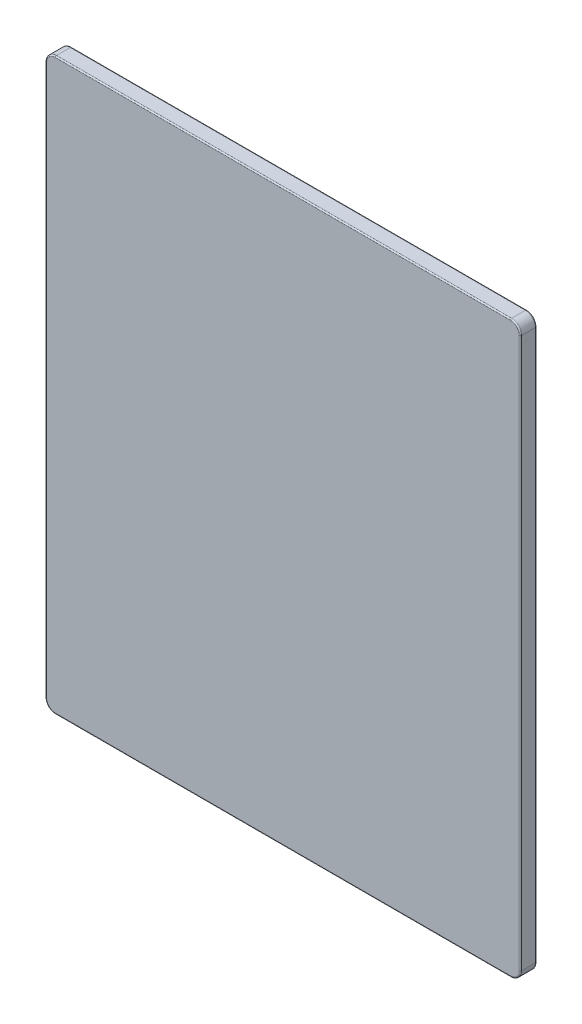
ISO-10303-21;
HEADER;
FILE_DESCRIPTION(('STEP AP214'),'2;1');
FILE_NAME('part.step','',(''),(''),'','','');
FILE_SCHEMA(('AUTOMOTIVE_DESIGN { 1 0 10303 214 1 1 1 1 }'));
ENDSEC;
DATA;
#1=APPLICATION_CONTEXT('core data for automotive mechanical design processes');
#2=APPLICATION_PROTOCOL_DEFINITION('international standard','automotive_design',2000,#1);
#3=PRODUCT_CONTEXT('',#1,'mechanical');
#4=PRODUCT('Part','Part','',(#3));
#5=PRODUCT_RELATED_PRODUCT_CATEGORY('part','',(#4));
#6=PRODUCT_DEFINITION_FORMATION('','',#4);
#7=PRODUCT_DEFINITION_CONTEXT('part definition',#1,'design');
#8=PRODUCT_DEFINITION('design','',#6,#7);
#9=PRODUCT_DEFINITION_SHAPE('','',#8);
#10=(LENGTH_UNIT() NAMED_UNIT(*) SI_UNIT(.MILLI.,.METRE.));
#11=(NAMED_UNIT(*) PLANE_ANGLE_UNIT() SI_UNIT($,.RADIAN.));
#12=(NAMED_UNIT(*) SI_UNIT($,.STERADIAN.) SOLID_ANGLE_UNIT());
#13=UNCERTAINTY_MEASURE_WITH_UNIT(LENGTH_MEASURE(1.E-05),#10,'distance_accuracy_value','');
#14=(GEOMETRIC_REPRESENTATION_CONTEXT(3) GLOBAL_UNCERTAINTY_ASSIGNED_CONTEXT((#13)) GLOBAL_UNIT_ASSIGNED_CONTEXT((#10,
#11,#12)) REPRESENTATION_CONTEXT('',''));
#15=CARTESIAN_POINT('',(0.,0.,0.));
#16=DIRECTION('',(0.,0.,1.));
#17=DIRECTION('',(1.,0.,0.));
#18=AXIS2_PLACEMENT_3D('',#15,#16,#17);
#19=CARTESIAN_POINT('',(190.5,-228.6,13.));
#20=DIRECTION('',(-1.,0.,0.));
#21=DIRECTION('',(0.,0.,1.));
#22=AXIS2_PLACEMENT_3D('',#19,#20,#21);
#23=PLANE('',#22);
#24=DIRECTION('',(0.,0.,-1.));
#25=VECTOR('',#24,1.);
#26=CARTESIAN_POINT('',(190.5,-220.6,13.));
#27=LINE('',#26,#25);
#28=CARTESIAN_POINT('',(190.5,-220.6,12.));
#29=VERTEX_POINT('',#28);
#30=CARTESIAN_POINT('',(190.5,-220.6,0.999999999999999));
#31=VERTEX_POINT('',#30);
#32=EDGE_CURVE('E334',#29,#31,#27,.T.);
#33=ORIENTED_EDGE('',*,*,#32,.T.);
#34=DIRECTION('',(0.,1.,0.));
#35=VECTOR('',#34,1.);
#36=CARTESIAN_POINT('',(190.5,220.6,0.999999999999999));
#37=LINE('',#36,#35);
#38=CARTESIAN_POINT('',(190.5,220.6,0.999999999999999));
#39=VERTEX_POINT('',#38);
#40=EDGE_CURVE('E221',#31,#39,#37,.T.);
#41=ORIENTED_EDGE('',*,*,#40,.T.);
#42=DIRECTION('',(0.,0.,-1.));
#43=VECTOR('',#42,1.);
#44=CARTESIAN_POINT('',(190.5,220.6,13.));
#45=LINE('',#44,#43);
#46=CARTESIAN_POINT('',(190.5,220.6,12.));
#47=VERTEX_POINT('',#46);
#48=EDGE_CURVE('E340',#39,#47,#45,.F.);
#49=ORIENTED_EDGE('',*,*,#48,.T.);
#50=DIRECTION('',(0.,1.,0.));
#51=VECTOR('',#50,1.);
#52=CARTESIAN_POINT('',(190.5,-228.6,12.));
#53=LINE('',#52,#51);
#54=EDGE_CURVE('E218',#47,#29,#53,.F.);
#55=ORIENTED_EDGE('',*,*,#54,.T.);
#56=EDGE_LOOP('',(#33,#41,#49,#55));
#57=FACE_BOUND('',#56,.T.);
#58=ADVANCED_FACE('F39',(#57),#23,.F.);
#59=CARTESIAN_POINT('',(-190.5,228.6,13.));
#60=DIRECTION('',(0.,-1.,0.));
#61=DIRECTION('',(0.,0.,-1.));
#62=AXIS2_PLACEMENT_3D('',#59,#60,#61);
#63=PLANE('',#62);
#64=DIRECTION('',(0.,0.,-1.));
#65=VECTOR('',#64,1.);
#66=CARTESIAN_POINT('',(182.5,228.6,13.));
#67=LINE('',#66,#65);
#68=CARTESIAN_POINT('',(182.5,228.6,12.));
#69=VERTEX_POINT('',#68);
#70=CARTESIAN_POINT('',(182.5,228.6,0.999999999999999));
#71=VERTEX_POINT('',#70);
#72=EDGE_CURVE('E331',#69,#71,#67,.T.);
#73=ORIENTED_EDGE('',*,*,#72,.T.);
#74=DIRECTION('',(-1.,0.,0.));
#75=VECTOR('',#74,1.);
#76=CARTESIAN_POINT('',(-182.5,228.6,0.999999999999999));
#77=LINE('',#76,#75);
#78=CARTESIAN_POINT('',(-182.5,228.6,0.999999999999999));
#79=VERTEX_POINT('',#78);
#80=EDGE_CURVE('E233',#71,#79,#77,.T.);
#81=ORIENTED_EDGE('',*,*,#80,.T.);
#82=DIRECTION('',(0.,0.,-1.));
#83=VECTOR('',#82,1.);
#84=CARTESIAN_POINT('',(-182.5,228.6,13.));
#85=LINE('',#84,#83);
#86=CARTESIAN_POINT('',(-182.5,228.6,12.));
#87=VERTEX_POINT('',#86);
#88=EDGE_CURVE('E279',#79,#87,#85,.F.);
#89=ORIENTED_EDGE('',*,*,#88,.T.);
#90=DIRECTION('',(-1.,0.,0.));
#91=VECTOR('',#90,1.);
#92=CARTESIAN_POINT('',(-190.5,228.6,12.));
#93=LINE('',#92,#91);
#94=EDGE_CURVE('E230',#87,#69,#93,.F.);
#95=ORIENTED_EDGE('',*,*,#94,.T.);
#96=EDGE_LOOP('',(#73,#81,#89,#95));
#97=FACE_BOUND('',#96,.T.);
#98=ADVANCED_FACE('F328',(#97),#63,.F.);
#99=CARTESIAN_POINT('',(-190.5,-228.6,13.));
#100=DIRECTION('',(1.,0.,0.));
#101=DIRECTION('',(0.,0.,-1.));
#102=AXIS2_PLACEMENT_3D('',#99,#100,#101);
#103=PLANE('',#102);
#104=DIRECTION('',(0.,0.,-1.));
#105=VECTOR('',#104,1.);
#106=CARTESIAN_POINT('',(-190.5,220.6,13.));
#107=LINE('',#106,#105);
#108=CARTESIAN_POINT('',(-190.5,220.6,12.));
#109=VERTEX_POINT('',#108);
#110=CARTESIAN_POINT('',(-190.5,220.6,0.999999999999999));
#111=VERTEX_POINT('',#110);
#112=EDGE_CURVE('E325',#109,#111,#107,.T.);
#113=ORIENTED_EDGE('',*,*,#112,.T.);
#114=DIRECTION('',(0.,-1.,0.));
#115=VECTOR('',#114,1.);
#116=CARTESIAN_POINT('',(-190.5,-220.6,0.999999999999999));
#117=LINE('',#116,#115);
#118=CARTESIAN_POINT('',(-190.5,-220.6,0.999999999999999));
#119=VERTEX_POINT('',#118);
#120=EDGE_CURVE('E196',#111,#119,#117,.T.);
#121=ORIENTED_EDGE('',*,*,#120,.T.);
#122=DIRECTION('',(0.,0.,-1.));
#123=VECTOR('',#122,1.);
#124=CARTESIAN_POINT('',(-190.5,-220.6,13.));
#125=LINE('',#124,#123);
#126=CARTESIAN_POINT('',(-190.5,-220.6,12.));
#127=VERTEX_POINT('',#126);
#128=EDGE_CURVE('E344',#119,#127,#125,.F.);
#129=ORIENTED_EDGE('',*,*,#128,.T.);
#130=DIRECTION('',(0.,-1.,0.));
#131=VECTOR('',#130,1.);
#132=CARTESIAN_POINT('',(-190.5,-228.6,12.));
#133=LINE('',#132,#131);
#134=EDGE_CURVE('E193',#127,#109,#133,.F.);
#135=ORIENTED_EDGE('',*,*,#134,.T.);
#136=EDGE_LOOP('',(#113,#121,#129,#135));
#137=FACE_BOUND('',#136,.T.);
#138=ADVANCED_FACE('F380',(#137),#103,.F.);
#139=CARTESIAN_POINT('',(-190.5,-228.6,13.));
#140=DIRECTION('',(0.,1.,0.));
#141=DIRECTION('',(0.,0.,1.));
#142=AXIS2_PLACEMENT_3D('',#139,#140,#141);
#143=PLANE('',#142);
#144=DIRECTION('',(0.,0.,-1.));
#145=VECTOR('',#144,1.);
#146=CARTESIAN_POINT('',(-182.5,-228.6,13.));
#147=LINE('',#146,#145);
#148=CARTESIAN_POINT('',(-182.5,-228.6,12.));
#149=VERTEX_POINT('',#148);
#150=CARTESIAN_POINT('',(-182.5,-228.6,0.999999999999999));
#151=VERTEX_POINT('',#150);
#152=EDGE_CURVE('E350',#149,#151,#147,.T.);
#153=ORIENTED_EDGE('',*,*,#152,.T.);
#154=DIRECTION('',(1.,0.,0.));
#155=VECTOR('',#154,1.);
#156=CARTESIAN_POINT('',(182.5,-228.6,0.999999999999999));
#157=LINE('',#156,#155);
#158=CARTESIAN_POINT('',(182.5,-228.6,0.999999999999999));
#159=VERTEX_POINT('',#158);
#160=EDGE_CURVE('E208',#151,#159,#157,.T.);
#161=ORIENTED_EDGE('',*,*,#160,.T.);
#162=DIRECTION('',(0.,0.,-1.));
#163=VECTOR('',#162,1.);
#164=CARTESIAN_POINT('',(182.5,-228.6,13.));
#165=LINE('',#164,#163);
#166=CARTESIAN_POINT('',(182.5,-228.6,12.));
#167=VERTEX_POINT('',#166);
#168=EDGE_CURVE('E175',#159,#167,#165,.F.);
#169=ORIENTED_EDGE('',*,*,#168,.T.);
#170=DIRECTION('',(1.,0.,0.));
#171=VECTOR('',#170,1.);
#172=CARTESIAN_POINT('',(-190.5,-228.6,12.));
#173=LINE('',#172,#171);
#174=EDGE_CURVE('E205',#167,#149,#173,.F.);
#175=ORIENTED_EDGE('',*,*,#174,.T.);
#176=EDGE_LOOP('',(#153,#161,#169,#175));
#177=FACE_BOUND('',#176,.T.);
#178=ADVANCED_FACE('F423',(#177),#143,.F.);
#179=CARTESIAN_POINT('',(0.,0.,13.));
#180=DIRECTION('',(0.,0.,-1.));
#181=DIRECTION('',(-1.,0.,0.));
#182=AXIS2_PLACEMENT_3D('',#179,#180,#181);
#183=PLANE('',#182);
#184=DIRECTION('',(1.,0.,0.));
#185=VECTOR('',#184,1.);
#186=CARTESIAN_POINT('',(0.,-227.6,13.));
#187=LINE('',#186,#185);
#188=CARTESIAN_POINT('',(-182.5,-227.6,13.));
#189=VERTEX_POINT('',#188);
#190=CARTESIAN_POINT('',(182.5,-227.6,13.));
#191=VERTEX_POINT('',#190);
#192=EDGE_CURVE('E49',#189,#191,#187,.T.);
#193=ORIENTED_EDGE('',*,*,#192,.T.);
#194=CARTESIAN_POINT('',(182.5,-220.6,13.));
#195=DIRECTION('',(0.,0.,-1.));
#196=DIRECTION('',(-1.,0.,0.));
#197=AXIS2_PLACEMENT_3D('',#194,#195,#196);
#198=CIRCLE('',#197,7.);
#199=CARTESIAN_POINT('',(189.5,-220.6,13.));
#200=VERTEX_POINT('',#199);
#201=EDGE_CURVE('E11',#191,#200,#198,.F.);
#202=ORIENTED_EDGE('',*,*,#201,.T.);
#203=DIRECTION('',(0.,1.,0.));
#204=VECTOR('',#203,1.);
#205=CARTESIAN_POINT('',(189.5,0.,13.));
#206=LINE('',#205,#204);
#207=CARTESIAN_POINT('',(189.5,220.6,13.));
#208=VERTEX_POINT('',#207);
#209=EDGE_CURVE('E236',#200,#208,#206,.T.);
#210=ORIENTED_EDGE('',*,*,#209,.T.);
#211=CARTESIAN_POINT('',(182.5,220.6,13.));
#212=DIRECTION('',(0.,0.,-1.));
#213=DIRECTION('',(-1.,0.,0.));
#214=AXIS2_PLACEMENT_3D('',#211,#212,#213);
#215=CIRCLE('',#214,7.);
#216=CARTESIAN_POINT('',(182.5,227.6,13.));
#217=VERTEX_POINT('',#216);
#218=EDGE_CURVE('E239',#208,#217,#215,.F.);
#219=ORIENTED_EDGE('',*,*,#218,.T.);
#220=DIRECTION('',(-1.,0.,0.));
#221=VECTOR('',#220,1.);
#222=CARTESIAN_POINT('',(0.,227.6,13.));
#223=LINE('',#222,#221);
#224=CARTESIAN_POINT('',(-182.5,227.6,13.));
#225=VERTEX_POINT('',#224);
#226=EDGE_CURVE('E242',#217,#225,#223,.T.);
#227=ORIENTED_EDGE('',*,*,#226,.T.);
#228=CARTESIAN_POINT('',(-182.5,220.6,13.));
#229=DIRECTION('',(0.,0.,-1.));
#230=DIRECTION('',(-1.,0.,0.));
#231=AXIS2_PLACEMENT_3D('',#228,#229,#230);
#232=CIRCLE('',#231,7.);
#233=CARTESIAN_POINT('',(-189.5,220.6,13.));
#234=VERTEX_POINT('',#233);
#235=EDGE_CURVE('E245',#225,#234,#232,.F.);
#236=ORIENTED_EDGE('',*,*,#235,.T.);
#237=DIRECTION('',(0.,-1.,0.));
#238=VECTOR('',#237,1.);
#239=CARTESIAN_POINT('',(-189.5,0.,13.));
#240=LINE('',#239,#238);
#241=CARTESIAN_POINT('',(-189.5,-220.6,13.));
#242=VERTEX_POINT('',#241);
#243=EDGE_CURVE('E248',#234,#242,#240,.T.);
#244=ORIENTED_EDGE('',*,*,#243,.T.);
#245=CARTESIAN_POINT('',(-182.5,-220.6,13.));
#246=DIRECTION('',(0.,0.,-1.));
#247=DIRECTION('',(-1.,0.,0.));
#248=AXIS2_PLACEMENT_3D('',#245,#246,#247);
#249=CIRCLE('',#248,7.);
#250=EDGE_CURVE('E60',#242,#189,#249,.F.);
#251=ORIENTED_EDGE('',*,*,#250,.T.);
#252=EDGE_LOOP('',(#193,#202,#210,#219,#227,#236,#244,#251));
#253=FACE_BOUND('',#252,.T.);
#254=ADVANCED_FACE('F396',(#253),#183,.F.);
#255=CARTESIAN_POINT('',(0.,0.,0.));
#256=DIRECTION('',(0.,0.,-1.));
#257=DIRECTION('',(-1.,0.,0.));
#258=AXIS2_PLACEMENT_3D('',#255,#256,#257);
#259=PLANE('',#258);
#260=DIRECTION('',(0.,-1.,0.));
#261=VECTOR('',#260,1.);
#262=CARTESIAN_POINT('',(-189.5,220.6,0.));
#263=LINE('',#262,#261);
#264=CARTESIAN_POINT('',(-189.5,-220.6,0.));
#265=VERTEX_POINT('',#264);
#266=CARTESIAN_POINT('',(-189.5,220.6,0.));
#267=VERTEX_POINT('',#266);
#268=EDGE_CURVE('E179',#265,#267,#263,.F.);
#269=ORIENTED_EDGE('',*,*,#268,.T.);
#270=CARTESIAN_POINT('',(-182.5,220.6,0.));
#271=DIRECTION('',(0.,0.,-1.));
#272=DIRECTION('',(-1.,0.,0.));
#273=AXIS2_PLACEMENT_3D('',#270,#271,#272);
#274=CIRCLE('',#273,7.);
#275=CARTESIAN_POINT('',(-182.5,227.6,0.));
#276=VERTEX_POINT('',#275);
#277=EDGE_CURVE('E158',#267,#276,#274,.T.);
#278=ORIENTED_EDGE('',*,*,#277,.T.);
#279=DIRECTION('',(-1.,0.,0.));
#280=VECTOR('',#279,1.);
#281=CARTESIAN_POINT('',(182.5,227.6,0.));
#282=LINE('',#281,#280);
#283=CARTESIAN_POINT('',(182.5,227.6,0.));
#284=VERTEX_POINT('',#283);
#285=EDGE_CURVE('E167',#276,#284,#282,.F.);
#286=ORIENTED_EDGE('',*,*,#285,.T.);
#287=CARTESIAN_POINT('',(182.5,220.6,0.));
#288=DIRECTION('',(0.,0.,-1.));
#289=DIRECTION('',(-1.,0.,0.));
#290=AXIS2_PLACEMENT_3D('',#287,#288,#289);
#291=CIRCLE('',#290,7.);
#292=CARTESIAN_POINT('',(189.5,220.6,0.));
#293=VERTEX_POINT('',#292);
#294=EDGE_CURVE('E174',#284,#293,#291,.T.);
#295=ORIENTED_EDGE('',*,*,#294,.T.);
#296=DIRECTION('',(0.,1.,0.));
#297=VECTOR('',#296,1.);
#298=CARTESIAN_POINT('',(189.5,-220.6,0.));
#299=LINE('',#298,#297);
#300=CARTESIAN_POINT('',(189.5,-220.6,0.));
#301=VERTEX_POINT('',#300);
#302=EDGE_CURVE('E359',#293,#301,#299,.F.);
#303=ORIENTED_EDGE('',*,*,#302,.T.);
#304=CARTESIAN_POINT('',(182.5,-220.6,0.));
#305=DIRECTION('',(0.,0.,-1.));
#306=DIRECTION('',(-1.,0.,0.));
#307=AXIS2_PLACEMENT_3D('',#304,#305,#306);
#308=CIRCLE('',#307,7.);
#309=CARTESIAN_POINT('',(182.5,-227.6,0.));
#310=VERTEX_POINT('',#309);
#311=EDGE_CURVE('E362',#301,#310,#308,.T.);
#312=ORIENTED_EDGE('',*,*,#311,.T.);
#313=DIRECTION('',(1.,0.,0.));
#314=VECTOR('',#313,1.);
#315=CARTESIAN_POINT('',(-182.5,-227.6,0.));
#316=LINE('',#315,#314);
#317=CARTESIAN_POINT('',(-182.5,-227.6,0.));
#318=VERTEX_POINT('',#317);
#319=EDGE_CURVE('E365',#310,#318,#316,.F.);
#320=ORIENTED_EDGE('',*,*,#319,.T.);
#321=CARTESIAN_POINT('',(-182.5,-220.6,0.));
#322=DIRECTION('',(0.,0.,-1.));
#323=DIRECTION('',(-1.,0.,0.));
#324=AXIS2_PLACEMENT_3D('',#321,#322,#323);
#325=CIRCLE('',#324,7.);
#326=EDGE_CURVE('E187',#318,#265,#325,.T.);
#327=ORIENTED_EDGE('',*,*,#326,.T.);
#328=EDGE_LOOP('',(#269,#278,#286,#295,#303,#312,#320,#327));
#329=FACE_BOUND('',#328,.T.);
#330=ADVANCED_FACE('F177',(#329),#259,.T.);
#331=CARTESIAN_POINT('',(182.5,220.6,13.));
#332=DIRECTION('',(0.,0.,-1.));
#333=DIRECTION('',(-1.,0.,0.));
#334=AXIS2_PLACEMENT_3D('',#331,#332,#333);
#335=CYLINDRICAL_SURFACE('',#334,8.);
#336=ORIENTED_EDGE('',*,*,#48,.F.);
#337=CARTESIAN_POINT('',(182.5,220.6,0.999999999999999));
#338=DIRECTION('',(0.,0.,-1.));
#339=DIRECTION('',(-1.,0.,0.));
#340=AXIS2_PLACEMENT_3D('',#337,#338,#339);
#341=CIRCLE('',#340,8.);
#342=EDGE_CURVE('E227',#39,#71,#341,.F.);
#343=ORIENTED_EDGE('',*,*,#342,.T.);
#344=ORIENTED_EDGE('',*,*,#72,.F.);
#345=CARTESIAN_POINT('',(182.5,220.6,12.));
#346=DIRECTION('',(0.,0.,-1.));
#347=DIRECTION('',(-1.,0.,0.));
#348=AXIS2_PLACEMENT_3D('',#345,#346,#347);
#349=CIRCLE('',#348,8.);
#350=EDGE_CURVE('E224',#69,#47,#349,.T.);
#351=ORIENTED_EDGE('',*,*,#350,.T.);
#352=EDGE_LOOP('',(#336,#343,#344,#351));
#353=FACE_BOUND('',#352,.T.);
#354=ADVANCED_FACE('F440',(#353),#335,.T.);
#355=CARTESIAN_POINT('',(-182.5,220.6,13.));
#356=DIRECTION('',(0.,0.,-1.));
#357=DIRECTION('',(-1.,0.,0.));
#358=AXIS2_PLACEMENT_3D('',#355,#356,#357);
#359=CYLINDRICAL_SURFACE('',#358,8.);
#360=ORIENTED_EDGE('',*,*,#88,.F.);
#361=CARTESIAN_POINT('',(-182.5,220.6,0.999999999999999));
#362=DIRECTION('',(0.,0.,-1.));
#363=DIRECTION('',(-1.,0.,0.));
#364=AXIS2_PLACEMENT_3D('',#361,#362,#363);
#365=CIRCLE('',#364,8.);
#366=EDGE_CURVE('E160',#79,#111,#365,.F.);
#367=ORIENTED_EDGE('',*,*,#366,.T.);
#368=ORIENTED_EDGE('',*,*,#112,.F.);
#369=CARTESIAN_POINT('',(-182.5,220.6,12.));
#370=DIRECTION('',(0.,0.,-1.));
#371=DIRECTION('',(-1.,0.,0.));
#372=AXIS2_PLACEMENT_3D('',#369,#370,#371);
#373=CIRCLE('',#372,8.);
#374=EDGE_CURVE('E182',#109,#87,#373,.T.);
#375=ORIENTED_EDGE('',*,*,#374,.T.);
#376=EDGE_LOOP('',(#360,#367,#368,#375));
#377=FACE_BOUND('',#376,.T.);
#378=ADVANCED_FACE('F323',(#377),#359,.T.);
#379=CARTESIAN_POINT('',(182.5,-220.6,13.));
#380=DIRECTION('',(0.,0.,-1.));
#381=DIRECTION('',(-1.,0.,0.));
#382=AXIS2_PLACEMENT_3D('',#379,#380,#381);
#383=CYLINDRICAL_SURFACE('',#382,8.);
#384=ORIENTED_EDGE('',*,*,#168,.F.);
#385=CARTESIAN_POINT('',(182.5,-220.6,0.999999999999999));
#386=DIRECTION('',(0.,0.,-1.));
#387=DIRECTION('',(-1.,0.,0.));
#388=AXIS2_PLACEMENT_3D('',#385,#386,#387);
#389=CIRCLE('',#388,8.);
#390=EDGE_CURVE('E215',#159,#31,#389,.F.);
#391=ORIENTED_EDGE('',*,*,#390,.T.);
#392=ORIENTED_EDGE('',*,*,#32,.F.);
#393=CARTESIAN_POINT('',(182.5,-220.6,12.));
#394=DIRECTION('',(0.,0.,-1.));
#395=DIRECTION('',(-1.,0.,0.));
#396=AXIS2_PLACEMENT_3D('',#393,#394,#395);
#397=CIRCLE('',#396,8.);
#398=EDGE_CURVE('E211',#29,#167,#397,.T.);
#399=ORIENTED_EDGE('',*,*,#398,.T.);
#400=EDGE_LOOP('',(#384,#391,#392,#399));
#401=FACE_BOUND('',#400,.T.);
#402=ADVANCED_FACE('F412',(#401),#383,.T.);
#403=CARTESIAN_POINT('',(-182.5,-220.6,13.));
#404=DIRECTION('',(0.,0.,-1.));
#405=DIRECTION('',(-1.,0.,0.));
#406=AXIS2_PLACEMENT_3D('',#403,#404,#405);
#407=CYLINDRICAL_SURFACE('',#406,8.);
#408=ORIENTED_EDGE('',*,*,#128,.F.);
#409=CARTESIAN_POINT('',(-182.5,-220.6,0.999999999999999));
#410=DIRECTION('',(0.,0.,-1.));
#411=DIRECTION('',(-1.,0.,0.));
#412=AXIS2_PLACEMENT_3D('',#409,#410,#411);
#413=CIRCLE('',#412,8.);
#414=EDGE_CURVE('E202',#119,#151,#413,.F.);
#415=ORIENTED_EDGE('',*,*,#414,.T.);
#416=ORIENTED_EDGE('',*,*,#152,.F.);
#417=CARTESIAN_POINT('',(-182.5,-220.6,12.));
#418=DIRECTION('',(0.,0.,-1.));
#419=DIRECTION('',(-1.,0.,0.));
#420=AXIS2_PLACEMENT_3D('',#417,#418,#419);
#421=CIRCLE('',#420,8.);
#422=EDGE_CURVE('E199',#149,#127,#421,.T.);
#423=ORIENTED_EDGE('',*,*,#422,.T.);
#424=EDGE_LOOP('',(#408,#415,#416,#423));
#425=FACE_BOUND('',#424,.T.);
#426=ADVANCED_FACE('F382',(#425),#407,.T.);
#427=CARTESIAN_POINT('',(182.5,-220.6,0.999999999999999));
#428=DIRECTION('',(0.,0.,-1.));
#429=DIRECTION('',(-1.,0.,0.));
#430=AXIS2_PLACEMENT_3D('',#427,#428,#429);
#431=TOROIDAL_SURFACE('',#430,7.,1.);
#432=CARTESIAN_POINT('',(189.5,-220.6,0.999999999999999));
#433=DIRECTION('',(0.,1.,0.));
#434=DIRECTION('',(0.,0.,1.));
#435=AXIS2_PLACEMENT_3D('',#432,#433,#434);
#436=CIRCLE('',#435,1.);
#437=EDGE_CURVE('E271',#31,#301,#436,.T.);
#438=ORIENTED_EDGE('',*,*,#437,.F.);
#439=ORIENTED_EDGE('',*,*,#390,.F.);
#440=CARTESIAN_POINT('',(182.5,-227.6,1.));
#441=DIRECTION('',(-1.,0.,0.));
#442=DIRECTION('',(0.,0.,1.));
#443=AXIS2_PLACEMENT_3D('',#440,#441,#442);
#444=CIRCLE('',#443,1.);
#445=EDGE_CURVE('E275',#310,#159,#444,.T.);
#446=ORIENTED_EDGE('',*,*,#445,.F.);
#447=ORIENTED_EDGE('',*,*,#311,.F.);
#448=EDGE_LOOP('',(#438,#439,#446,#447));
#449=FACE_BOUND('',#448,.T.);
#450=ADVANCED_FACE('F416',(#449),#431,.T.);
#451=CARTESIAN_POINT('',(-190.5,-227.6,0.999999999999999));
#452=DIRECTION('',(-1.,0.,0.));
#453=DIRECTION('',(0.,0.,1.));
#454=AXIS2_PLACEMENT_3D('',#451,#452,#453);
#455=CYLINDRICAL_SURFACE('',#454,1.);
#456=ORIENTED_EDGE('',*,*,#445,.T.);
#457=ORIENTED_EDGE('',*,*,#160,.F.);
#458=CARTESIAN_POINT('',(-182.5,-227.6,1.));
#459=DIRECTION('',(-1.,0.,0.));
#460=DIRECTION('',(0.,0.,1.));
#461=AXIS2_PLACEMENT_3D('',#458,#459,#460);
#462=CIRCLE('',#461,1.);
#463=EDGE_CURVE('E267',#318,#151,#462,.T.);
#464=ORIENTED_EDGE('',*,*,#463,.F.);
#465=ORIENTED_EDGE('',*,*,#319,.F.);
#466=EDGE_LOOP('',(#456,#457,#464,#465));
#467=FACE_BOUND('',#466,.T.);
#468=ADVANCED_FACE('F421',(#467),#455,.T.);
#469=CARTESIAN_POINT('',(189.5,-228.6,0.999999999999999));
#470=DIRECTION('',(0.,-1.,0.));
#471=DIRECTION('',(0.,0.,-1.));
#472=AXIS2_PLACEMENT_3D('',#469,#470,#471);
#473=CYLINDRICAL_SURFACE('',#472,1.);
#474=ORIENTED_EDGE('',*,*,#437,.T.);
#475=ORIENTED_EDGE('',*,*,#302,.F.);
#476=CARTESIAN_POINT('',(189.5,220.6,0.999999999999999));
#477=DIRECTION('',(0.,1.,0.));
#478=DIRECTION('',(0.,0.,1.));
#479=AXIS2_PLACEMENT_3D('',#476,#477,#478);
#480=CIRCLE('',#479,1.);
#481=EDGE_CURVE('E263',#39,#293,#480,.T.);
#482=ORIENTED_EDGE('',*,*,#481,.F.);
#483=ORIENTED_EDGE('',*,*,#40,.F.);
#484=EDGE_LOOP('',(#474,#475,#482,#483));
#485=FACE_BOUND('',#484,.T.);
#486=ADVANCED_FACE('F462',(#485),#473,.T.);
#487=CARTESIAN_POINT('',(-182.5,-220.6,0.999999999999999));
#488=DIRECTION('',(0.,0.,-1.));
#489=DIRECTION('',(-1.,0.,0.));
#490=AXIS2_PLACEMENT_3D('',#487,#488,#489);
#491=TOROIDAL_SURFACE('',#490,7.,1.);
#492=ORIENTED_EDGE('',*,*,#463,.T.);
#493=ORIENTED_EDGE('',*,*,#414,.F.);
#494=CARTESIAN_POINT('',(-189.5,-220.6,1.));
#495=DIRECTION('',(0.,1.,0.));
#496=DIRECTION('',(0.,0.,1.));
#497=AXIS2_PLACEMENT_3D('',#494,#495,#496);
#498=CIRCLE('',#497,1.);
#499=EDGE_CURVE('E259',#265,#119,#498,.T.);
#500=ORIENTED_EDGE('',*,*,#499,.F.);
#501=ORIENTED_EDGE('',*,*,#326,.F.);
#502=EDGE_LOOP('',(#492,#493,#500,#501));
#503=FACE_BOUND('',#502,.T.);
#504=ADVANCED_FACE('F374',(#503),#491,.T.);
#505=CARTESIAN_POINT('',(182.5,220.6,0.999999999999999));
#506=DIRECTION('',(0.,0.,-1.));
#507=DIRECTION('',(-1.,0.,0.));
#508=AXIS2_PLACEMENT_3D('',#505,#506,#507);
#509=TOROIDAL_SURFACE('',#508,7.,1.);
#510=ORIENTED_EDGE('',*,*,#481,.T.);
#511=ORIENTED_EDGE('',*,*,#294,.F.);
#512=CARTESIAN_POINT('',(182.5,227.6,0.999999999999999));
#513=DIRECTION('',(-1.,0.,0.));
#514=DIRECTION('',(0.,0.,1.));
#515=AXIS2_PLACEMENT_3D('',#512,#513,#514);
#516=CIRCLE('',#515,1.);
#517=EDGE_CURVE('E170',#71,#284,#516,.T.);
#518=ORIENTED_EDGE('',*,*,#517,.F.);
#519=ORIENTED_EDGE('',*,*,#342,.F.);
#520=EDGE_LOOP('',(#510,#511,#518,#519));
#521=FACE_BOUND('',#520,.T.);
#522=ADVANCED_FACE('F456',(#521),#509,.T.);
#523=CARTESIAN_POINT('',(-189.5,-228.6,0.999999999999999));
#524=DIRECTION('',(0.,1.,0.));
#525=DIRECTION('',(0.,0.,1.));
#526=AXIS2_PLACEMENT_3D('',#523,#524,#525);
#527=CYLINDRICAL_SURFACE('',#526,1.);
#528=ORIENTED_EDGE('',*,*,#499,.T.);
#529=ORIENTED_EDGE('',*,*,#120,.F.);
#530=CARTESIAN_POINT('',(-189.5,220.6,1.));
#531=DIRECTION('',(0.,1.,0.));
#532=DIRECTION('',(0.,0.,1.));
#533=AXIS2_PLACEMENT_3D('',#530,#531,#532);
#534=CIRCLE('',#533,1.);
#535=EDGE_CURVE('E164',#267,#111,#534,.T.);
#536=ORIENTED_EDGE('',*,*,#535,.F.);
#537=ORIENTED_EDGE('',*,*,#268,.F.);
#538=EDGE_LOOP('',(#528,#529,#536,#537));
#539=FACE_BOUND('',#538,.T.);
#540=ADVANCED_FACE('F377',(#539),#527,.T.);
#541=CARTESIAN_POINT('',(-190.5,227.6,0.999999999999999));
#542=DIRECTION('',(1.,0.,0.));
#543=DIRECTION('',(0.,0.,-1.));
#544=AXIS2_PLACEMENT_3D('',#541,#542,#543);
#545=CYLINDRICAL_SURFACE('',#544,1.);
#546=ORIENTED_EDGE('',*,*,#517,.T.);
#547=ORIENTED_EDGE('',*,*,#285,.F.);
#548=CARTESIAN_POINT('',(-182.5,227.6,0.999999999999999));
#549=DIRECTION('',(-1.,0.,0.));
#550=DIRECTION('',(0.,0.,1.));
#551=AXIS2_PLACEMENT_3D('',#548,#549,#550);
#552=CIRCLE('',#551,1.);
#553=EDGE_CURVE('E154',#79,#276,#552,.T.);
#554=ORIENTED_EDGE('',*,*,#553,.F.);
#555=ORIENTED_EDGE('',*,*,#80,.F.);
#556=EDGE_LOOP('',(#546,#547,#554,#555));
#557=FACE_BOUND('',#556,.T.);
#558=ADVANCED_FACE('F168',(#557),#545,.T.);
#559=CARTESIAN_POINT('',(-182.5,220.6,0.999999999999999));
#560=DIRECTION('',(0.,0.,-1.));
#561=DIRECTION('',(-1.,0.,0.));
#562=AXIS2_PLACEMENT_3D('',#559,#560,#561);
#563=TOROIDAL_SURFACE('',#562,7.,1.);
#564=ORIENTED_EDGE('',*,*,#535,.T.);
#565=ORIENTED_EDGE('',*,*,#366,.F.);
#566=ORIENTED_EDGE('',*,*,#553,.T.);
#567=ORIENTED_EDGE('',*,*,#277,.F.);
#568=EDGE_LOOP('',(#564,#565,#566,#567));
#569=FACE_BOUND('',#568,.T.);
#570=ADVANCED_FACE('F156',(#569),#563,.T.);
#571=CARTESIAN_POINT('',(-182.5,220.6,12.));
#572=DIRECTION('',(0.,0.,-1.));
#573=DIRECTION('',(-1.,0.,0.));
#574=AXIS2_PLACEMENT_3D('',#571,#572,#573);
#575=TOROIDAL_SURFACE('',#574,7.,1.);
#576=CARTESIAN_POINT('',(-182.5,227.6,12.));
#577=DIRECTION('',(1.,0.,0.));
#578=DIRECTION('',(0.,0.,-1.));
#579=AXIS2_PLACEMENT_3D('',#576,#577,#578);
#580=CIRCLE('',#579,1.);
#581=EDGE_CURVE('E301',#87,#225,#580,.T.);
#582=ORIENTED_EDGE('',*,*,#581,.F.);
#583=ORIENTED_EDGE('',*,*,#374,.F.);
#584=CARTESIAN_POINT('',(-189.5,220.6,12.));
#585=DIRECTION('',(0.,-1.,0.));
#586=DIRECTION('',(0.,0.,-1.));
#587=AXIS2_PLACEMENT_3D('',#584,#585,#586);
#588=CIRCLE('',#587,1.);
#589=EDGE_CURVE('E43',#234,#109,#588,.T.);
#590=ORIENTED_EDGE('',*,*,#589,.F.);
#591=ORIENTED_EDGE('',*,*,#235,.F.);
#592=EDGE_LOOP('',(#582,#583,#590,#591));
#593=FACE_BOUND('',#592,.T.);
#594=ADVANCED_FACE('F41',(#593),#575,.T.);
#595=CARTESIAN_POINT('',(-189.5,0.,12.));
#596=DIRECTION('',(0.,-1.,0.));
#597=DIRECTION('',(0.,0.,-1.));
#598=AXIS2_PLACEMENT_3D('',#595,#596,#597);
#599=CYLINDRICAL_SURFACE('',#598,1.);
#600=ORIENTED_EDGE('',*,*,#589,.T.);
#601=ORIENTED_EDGE('',*,*,#134,.F.);
#602=CARTESIAN_POINT('',(-189.5,-220.6,12.));
#603=DIRECTION('',(0.,-1.,0.));
#604=DIRECTION('',(0.,0.,-1.));
#605=AXIS2_PLACEMENT_3D('',#602,#603,#604);
#606=CIRCLE('',#605,1.);
#607=EDGE_CURVE('E298',#242,#127,#606,.T.);
#608=ORIENTED_EDGE('',*,*,#607,.F.);
#609=ORIENTED_EDGE('',*,*,#243,.F.);
#610=EDGE_LOOP('',(#600,#601,#608,#609));
#611=FACE_BOUND('',#610,.T.);
#612=ADVANCED_FACE('F314',(#611),#599,.T.);
#613=CARTESIAN_POINT('',(0.,227.6,12.));
#614=DIRECTION('',(-1.,0.,0.));
#615=DIRECTION('',(0.,0.,1.));
#616=AXIS2_PLACEMENT_3D('',#613,#614,#615);
#617=CYLINDRICAL_SURFACE('',#616,1.);
#618=ORIENTED_EDGE('',*,*,#581,.T.);
#619=ORIENTED_EDGE('',*,*,#226,.F.);
#620=CARTESIAN_POINT('',(182.5,227.6,12.));
#621=DIRECTION('',(1.,0.,0.));
#622=DIRECTION('',(0.,0.,-1.));
#623=AXIS2_PLACEMENT_3D('',#620,#621,#622);
#624=CIRCLE('',#623,1.);
#625=EDGE_CURVE('E294',#69,#217,#624,.T.);
#626=ORIENTED_EDGE('',*,*,#625,.F.);
#627=ORIENTED_EDGE('',*,*,#94,.F.);
#628=EDGE_LOOP('',(#618,#619,#626,#627));
#629=FACE_BOUND('',#628,.T.);
#630=ADVANCED_FACE('F480',(#629),#617,.T.);
#631=CARTESIAN_POINT('',(-182.5,-220.6,12.));
#632=DIRECTION('',(0.,0.,-1.));
#633=DIRECTION('',(-1.,0.,0.));
#634=AXIS2_PLACEMENT_3D('',#631,#632,#633);
#635=TOROIDAL_SURFACE('',#634,7.,1.);
#636=ORIENTED_EDGE('',*,*,#607,.T.);
#637=ORIENTED_EDGE('',*,*,#422,.F.);
#638=CARTESIAN_POINT('',(-182.5,-227.6,12.));
#639=DIRECTION('',(1.,0.,0.));
#640=DIRECTION('',(0.,0.,-1.));
#641=AXIS2_PLACEMENT_3D('',#638,#639,#640);
#642=CIRCLE('',#641,1.);
#643=EDGE_CURVE('E290',#189,#149,#642,.T.);
#644=ORIENTED_EDGE('',*,*,#643,.F.);
#645=ORIENTED_EDGE('',*,*,#250,.F.);
#646=EDGE_LOOP('',(#636,#637,#644,#645));
#647=FACE_BOUND('',#646,.T.);
#648=ADVANCED_FACE('F386',(#647),#635,.T.);
#649=CARTESIAN_POINT('',(182.5,220.6,12.));
#650=DIRECTION('',(0.,0.,-1.));
#651=DIRECTION('',(-1.,0.,0.));
#652=AXIS2_PLACEMENT_3D('',#649,#650,#651);
#653=TOROIDAL_SURFACE('',#652,7.,1.);
#654=ORIENTED_EDGE('',*,*,#625,.T.);
#655=ORIENTED_EDGE('',*,*,#218,.F.);
#656=CARTESIAN_POINT('',(189.5,220.6,12.));
#657=DIRECTION('',(0.,-1.,0.));
#658=DIRECTION('',(0.,0.,-1.));
#659=AXIS2_PLACEMENT_3D('',#656,#657,#658);
#660=CIRCLE('',#659,1.);
#661=EDGE_CURVE('E286',#47,#208,#660,.T.);
#662=ORIENTED_EDGE('',*,*,#661,.F.);
#663=ORIENTED_EDGE('',*,*,#350,.F.);
#664=EDGE_LOOP('',(#654,#655,#662,#663));
#665=FACE_BOUND('',#664,.T.);
#666=ADVANCED_FACE('F401',(#665),#653,.T.);
#667=CARTESIAN_POINT('',(0.,-227.6,12.));
#668=DIRECTION('',(1.,0.,0.));
#669=DIRECTION('',(0.,0.,-1.));
#670=AXIS2_PLACEMENT_3D('',#667,#668,#669);
#671=CYLINDRICAL_SURFACE('',#670,1.);
#672=ORIENTED_EDGE('',*,*,#643,.T.);
#673=ORIENTED_EDGE('',*,*,#174,.F.);
#674=CARTESIAN_POINT('',(182.5,-227.6,12.));
#675=DIRECTION('',(1.,0.,0.));
#676=DIRECTION('',(0.,0.,-1.));
#677=AXIS2_PLACEMENT_3D('',#674,#675,#676);
#678=CIRCLE('',#677,1.);
#679=EDGE_CURVE('E283',#191,#167,#678,.T.);
#680=ORIENTED_EDGE('',*,*,#679,.F.);
#681=ORIENTED_EDGE('',*,*,#192,.F.);
#682=EDGE_LOOP('',(#672,#673,#680,#681));
#683=FACE_BOUND('',#682,.T.);
#684=ADVANCED_FACE('F389',(#683),#671,.T.);
#685=CARTESIAN_POINT('',(189.5,0.,12.));
#686=DIRECTION('',(0.,1.,0.));
#687=DIRECTION('',(0.,0.,1.));
#688=AXIS2_PLACEMENT_3D('',#685,#686,#687);
#689=CYLINDRICAL_SURFACE('',#688,1.);
#690=ORIENTED_EDGE('',*,*,#661,.T.);
#691=ORIENTED_EDGE('',*,*,#209,.F.);
#692=CARTESIAN_POINT('',(189.5,-220.6,12.));
#693=DIRECTION('',(0.,-1.,0.));
#694=DIRECTION('',(0.,0.,-1.));
#695=AXIS2_PLACEMENT_3D('',#692,#693,#694);
#696=CIRCLE('',#695,1.);
#697=EDGE_CURVE('E280',#29,#200,#696,.T.);
#698=ORIENTED_EDGE('',*,*,#697,.F.);
#699=ORIENTED_EDGE('',*,*,#54,.F.);
#700=EDGE_LOOP('',(#690,#691,#698,#699));
#701=FACE_BOUND('',#700,.T.);
#702=ADVANCED_FACE('F405',(#701),#689,.T.);
#703=CARTESIAN_POINT('',(182.5,-220.6,12.));
#704=DIRECTION('',(0.,0.,-1.));
#705=DIRECTION('',(-1.,0.,0.));
#706=AXIS2_PLACEMENT_3D('',#703,#704,#705);
#707=TOROIDAL_SURFACE('',#706,7.,1.);
#708=ORIENTED_EDGE('',*,*,#679,.T.);
#709=ORIENTED_EDGE('',*,*,#398,.F.);
#710=ORIENTED_EDGE('',*,*,#697,.T.);
#711=ORIENTED_EDGE('',*,*,#201,.F.);
#712=EDGE_LOOP('',(#708,#709,#710,#711));
#713=FACE_BOUND('',#712,.T.);
#714=ADVANCED_FACE('F393',(#713),#707,.T.);
#715=CLOSED_SHELL('',(#58,#98,#138,#178,#254,#330,#354,#378,#402,#426,#450,#468,#486,#504,#522,
#540,#558,#570,#594,#612,#630,#648,#666,#684,#702,#714));
#716=MANIFOLD_SOLID_BREP('B2',#715);
#717=ADVANCED_BREP_SHAPE_REPRESENTATION('',(#18,#716),#14);
#718=SHAPE_DEFINITION_REPRESENTATION(#9,#717);
ENDSEC;
END-ISO-10303-21;
